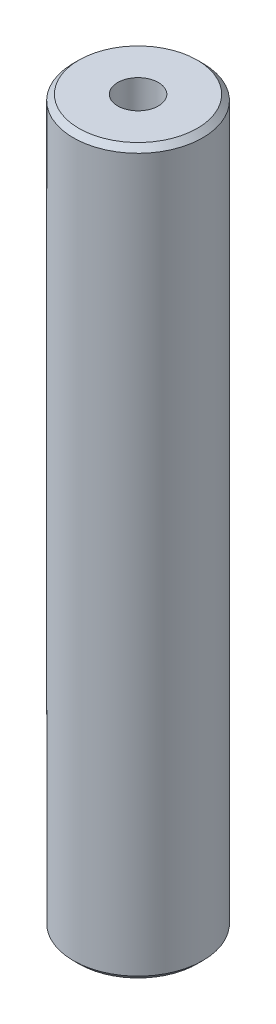
ISO-10303-21;
HEADER;
FILE_DESCRIPTION(('STEP AP214'),'2;1');
FILE_NAME('part.step','',(''),(''),'','','');
FILE_SCHEMA(('AUTOMOTIVE_DESIGN { 1 0 10303 214 1 1 1 1 }'));
ENDSEC;
DATA;
#1=APPLICATION_CONTEXT('core data for automotive mechanical design processes');
#2=APPLICATION_PROTOCOL_DEFINITION('international standard','automotive_design',2000,#1);
#3=PRODUCT_CONTEXT('',#1,'mechanical');
#4=PRODUCT('Part','Part','',(#3));
#5=PRODUCT_RELATED_PRODUCT_CATEGORY('part','',(#4));
#6=PRODUCT_DEFINITION_FORMATION('','',#4);
#7=PRODUCT_DEFINITION_CONTEXT('part definition',#1,'design');
#8=PRODUCT_DEFINITION('design','',#6,#7);
#9=PRODUCT_DEFINITION_SHAPE('','',#8);
#10=(LENGTH_UNIT() NAMED_UNIT(*) SI_UNIT(.MILLI.,.METRE.));
#11=(NAMED_UNIT(*) PLANE_ANGLE_UNIT() SI_UNIT($,.RADIAN.));
#12=(NAMED_UNIT(*) SI_UNIT($,.STERADIAN.) SOLID_ANGLE_UNIT());
#13=UNCERTAINTY_MEASURE_WITH_UNIT(LENGTH_MEASURE(1.E-05),#10,'distance_accuracy_value','');
#14=(GEOMETRIC_REPRESENTATION_CONTEXT(3) GLOBAL_UNCERTAINTY_ASSIGNED_CONTEXT((#13)) GLOBAL_UNIT_ASSIGNED_CONTEXT((#10,
#11,#12)) REPRESENTATION_CONTEXT('',''));
#15=CARTESIAN_POINT('',(0.,0.,0.));
#16=DIRECTION('',(0.,0.,1.));
#17=DIRECTION('',(1.,0.,0.));
#18=AXIS2_PLACEMENT_3D('',#15,#16,#17);
#19=CARTESIAN_POINT('',(0.,167.896019457677,0.));
#20=DIRECTION('',(0.,-1.,0.));
#21=DIRECTION('',(0.,0.,-1.));
#22=AXIS2_PLACEMENT_3D('',#19,#20,#21);
#23=CYLINDRICAL_SURFACE('',#22,15.);
#24=CARTESIAN_POINT('',(0.,166.628306279116,0.));
#25=DIRECTION('',(0.,1.,0.));
#26=DIRECTION('',(0.,0.,1.));
#27=AXIS2_PLACEMENT_3D('',#24,#25,#26);
#28=CIRCLE('',#27,15.);
#29=CARTESIAN_POINT('',(0.,166.628306279116,-15.));
#30=VERTEX_POINT('',#29);
#31=EDGE_CURVE('E50',#30,#30,#28,.F.);
#32=CARTESIAN_POINT('',(0.,1.26771317856134,0.));
#33=DIRECTION('',(0.,1.,0.));
#34=DIRECTION('',(0.,0.,1.));
#35=AXIS2_PLACEMENT_3D('',#32,#33,#34);
#36=CIRCLE('',#35,15.);
#37=CARTESIAN_POINT('',(0.,1.26771317856134,-15.));
#38=VERTEX_POINT('',#37);
#39=EDGE_CURVE('E51',#38,#38,#36,.T.);
#40=CARTESIAN_POINT('',(0.,166.628306279116,-15.));
#41=CARTESIAN_POINT('',(0.,164.905800100985,-15.));
#42=CARTESIAN_POINT('',(0.,163.183293922854,-15.));
#43=CARTESIAN_POINT('',(0.,159.738281566593,-15.));
#44=CARTESIAN_POINT('',(0.,158.015775388462,-15.));
#45=CARTESIAN_POINT('',(0.,154.570763032201,-15.));
#46=CARTESIAN_POINT('',(0.,152.84825685407,-15.));
#47=CARTESIAN_POINT('',(0.,149.403244497808,-15.));
#48=CARTESIAN_POINT('',(0.,147.680738319677,-15.));
#49=CARTESIAN_POINT('',(0.,144.235725963416,-15.));
#50=CARTESIAN_POINT('',(0.,142.513219785285,-15.));
#51=CARTESIAN_POINT('',(0.,139.068207429024,-15.));
#52=CARTESIAN_POINT('',(0.,137.345701250893,-15.));
#53=CARTESIAN_POINT('',(0.,133.900688894631,-15.));
#54=CARTESIAN_POINT('',(0.,132.1781827165,-15.));
#55=CARTESIAN_POINT('',(0.,128.733170360239,-15.));
#56=CARTESIAN_POINT('',(0.,127.010664182108,-15.));
#57=CARTESIAN_POINT('',(0.,123.565651825847,-15.));
#58=CARTESIAN_POINT('',(0.,121.843145647716,-15.));
#59=CARTESIAN_POINT('',(0.,118.398133291454,-15.));
#60=CARTESIAN_POINT('',(0.,116.675627113323,-15.));
#61=CARTESIAN_POINT('',(0.,113.230614757062,-15.));
#62=CARTESIAN_POINT('',(0.,111.508108578931,-15.));
#63=CARTESIAN_POINT('',(0.,108.06309622267,-15.));
#64=CARTESIAN_POINT('',(0.,106.340590044539,-15.));
#65=CARTESIAN_POINT('',(0.,102.895577688277,-15.));
#66=CARTESIAN_POINT('',(0.,101.173071510146,-15.));
#67=CARTESIAN_POINT('',(0.,97.7280591538849,-15.));
#68=CARTESIAN_POINT('',(0.,96.0055529757542,-15.));
#69=CARTESIAN_POINT('',(0.,92.5605406194926,-15.));
#70=CARTESIAN_POINT('',(0.,90.8380344413618,-15.));
#71=CARTESIAN_POINT('',(0.,87.3930220851003,-15.));
#72=CARTESIAN_POINT('',(0.,85.6705159069695,-15.));
#73=CARTESIAN_POINT('',(0.,82.2255035507079,-15.));
#74=CARTESIAN_POINT('',(0.,80.5029973725771,-15.));
#75=CARTESIAN_POINT('',(0.,77.0579850163156,-15.));
#76=CARTESIAN_POINT('',(0.,75.3354788381848,-15.));
#77=CARTESIAN_POINT('',(0.,71.8904664819233,-15.));
#78=CARTESIAN_POINT('',(0.,70.1679603037925,-15.));
#79=CARTESIAN_POINT('',(0.,66.7229479475309,-15.));
#80=CARTESIAN_POINT('',(0.,65.0004417694001,-15.));
#81=CARTESIAN_POINT('',(0.,61.5554294131386,-15.));
#82=CARTESIAN_POINT('',(0.,59.8329232350078,-15.));
#83=CARTESIAN_POINT('',(0.,56.3879108787462,-15.));
#84=CARTESIAN_POINT('',(0.,54.6654047006155,-15.));
#85=CARTESIAN_POINT('',(0.,51.2203923443539,-15.));
#86=CARTESIAN_POINT('',(0.,49.4978861662231,-15.));
#87=CARTESIAN_POINT('',(0.,46.0528738099616,-15.));
#88=CARTESIAN_POINT('',(0.,44.3303676318308,-15.));
#89=CARTESIAN_POINT('',(0.,40.8853552755692,-15.));
#90=CARTESIAN_POINT('',(0.,39.1628490974385,-15.));
#91=CARTESIAN_POINT('',(0.,35.7178367411769,-15.));
#92=CARTESIAN_POINT('',(0.,33.9953305630461,-15.));
#93=CARTESIAN_POINT('',(0.,30.5503182067846,-15.));
#94=CARTESIAN_POINT('',(0.,28.8278120286538,-15.));
#95=CARTESIAN_POINT('',(0.,25.3827996723922,-15.));
#96=CARTESIAN_POINT('',(0.,23.6602934942614,-15.));
#97=CARTESIAN_POINT('',(0.,20.2152811379999,-15.));
#98=CARTESIAN_POINT('',(0.,18.4927749598691,-15.));
#99=CARTESIAN_POINT('',(0.,15.0477626036076,-15.));
#100=CARTESIAN_POINT('',(0.,13.3252564254768,-15.));
#101=CARTESIAN_POINT('',(0.,9.88024406921523,-15.));
#102=CARTESIAN_POINT('',(0.,8.15773789108446,-15.));
#103=CARTESIAN_POINT('',(0.,4.7127255348229,-15.));
#104=CARTESIAN_POINT('',(0.,2.99021935669212,-15.));
#105=CARTESIAN_POINT('',(0.,1.26771317856134,-15.));
#106=B_SPLINE_CURVE_WITH_KNOTS('',3,(#40,#41,#42,#43,#44,#45,#46,#47,#48,#49,#50,#51,#52,#53,
#54,#55,#56,#57,#58,#59,#60,#61,#62,#63,#64,#65,#66,#67,#68,#69,#70,#71,#72,#73,#74,#75,#76,#77,
#78,#79,#80,#81,#82,#83,#84,#85,#86,#87,#88,#89,#90,#91,#92,#93,#94,#95,#96,#97,#98,#99,#100,
#101,#102,#103,#104,#105),.UNSPECIFIED.,.F.,.F.,(4,2,2,2,2,2,2,2,2,2,2,2,2,2,2,2,2,2,2,2,2,2,2,
2,2,2,2,2,2,2,2,2,4),(0.,5.16751853439232,10.3350370687847,15.502555603177,20.6700741375693,
25.8375926719616,31.005111206354,36.1726297407463,41.3401482751387,46.507666809531,
51.6751853439233,56.8427038783157,62.010222412708,67.1777409471003,72.3452594814927,
77.512778015885,82.6802965502773,87.8478150846697,93.015333619062,98.1828521534543,
103.350370687847,108.517889222239,113.685407756631,118.852926291024,124.020444825416,
129.187963359808,134.355481894201,139.523000428593,144.690518962985,149.858037497378,
155.02555603177,160.193074566162,165.360593100555),.UNSPECIFIED.);
#107=EDGE_CURVE('BSEAM39',#30,#38,#106,.T.);
#108=ORIENTED_EDGE('',*,*,#31,.T.);
#109=ORIENTED_EDGE('',*,*,#39,.T.);
#110=ORIENTED_EDGE('',*,*,#107,.T.);
#111=ORIENTED_EDGE('',*,*,#107,.F.);
#112=EDGE_LOOP('',(#108,#110,#109,#111));
#113=FACE_BOUND('',#112,.T.);
#114=ADVANCED_FACE('F39',(#113),#23,.T.);
#115=CARTESIAN_POINT('',(0.,167.896019457677,0.));
#116=DIRECTION('',(0.,1.,0.));
#117=DIRECTION('',(0.,0.,1.));
#118=AXIS2_PLACEMENT_3D('',#115,#116,#117);
#119=PLANE('',#118);
#120=CARTESIAN_POINT('',(0.,167.896019457677,0.));
#121=DIRECTION('',(0.,1.,0.));
#122=DIRECTION('',(0.,0.,1.));
#123=AXIS2_PLACEMENT_3D('',#120,#121,#122);
#124=CIRCLE('',#123,13.7322868214389);
#125=CARTESIAN_POINT('',(0.,167.896019457677,13.7322868214389));
#126=VERTEX_POINT('',#125);
#127=EDGE_CURVE('E54',#126,#126,#124,.T.);
#128=ORIENTED_EDGE('',*,*,#127,.T.);
#129=EDGE_LOOP('',(#128));
#130=FACE_BOUND('',#129,.T.);
#131=CARTESIAN_POINT('',(0.,167.896019457677,0.));
#132=DIRECTION('',(0.,1.,0.));
#133=DIRECTION('',(0.,0.,1.));
#134=AXIS2_PLACEMENT_3D('',#131,#132,#133);
#135=CIRCLE('',#134,4.72413045080099);
#136=CARTESIAN_POINT('',(0.,167.896019457677,-4.72413045080099));
#137=VERTEX_POINT('',#136);
#138=EDGE_CURVE('E58',#137,#137,#135,.T.);
#139=ORIENTED_EDGE('',*,*,#138,.F.);
#140=EDGE_LOOP('',(#139));
#141=FACE_BOUND('',#140,.T.);
#142=ADVANCED_FACE('F69',(#130,#141),#119,.T.);
#143=CARTESIAN_POINT('',(0.,0.,0.));
#144=DIRECTION('',(0.,1.,0.));
#145=DIRECTION('',(0.,0.,1.));
#146=AXIS2_PLACEMENT_3D('',#143,#144,#145);
#147=PLANE('',#146);
#148=CARTESIAN_POINT('',(0.,0.,0.));
#149=DIRECTION('',(0.,1.,0.));
#150=DIRECTION('',(0.,0.,1.));
#151=AXIS2_PLACEMENT_3D('',#148,#149,#150);
#152=CIRCLE('',#151,13.7322868214386);
#153=CARTESIAN_POINT('',(0.,0.,13.7322868214386));
#154=VERTEX_POINT('',#153);
#155=EDGE_CURVE('E10',#154,#154,#152,.F.);
#156=ORIENTED_EDGE('',*,*,#155,.T.);
#157=EDGE_LOOP('',(#156));
#158=FACE_BOUND('',#157,.T.);
#159=CARTESIAN_POINT('',(0.,0.,0.));
#160=DIRECTION('',(0.,1.,0.));
#161=DIRECTION('',(0.,0.,1.));
#162=AXIS2_PLACEMENT_3D('',#159,#160,#161);
#163=CIRCLE('',#162,4.72413045080099);
#164=CARTESIAN_POINT('',(0.,0.,-4.72413045080099));
#165=VERTEX_POINT('',#164);
#166=EDGE_CURVE('E63',#165,#165,#163,.T.);
#167=ORIENTED_EDGE('',*,*,#166,.T.);
#168=EDGE_LOOP('',(#167));
#169=FACE_BOUND('',#168,.T.);
#170=ADVANCED_FACE('F75',(#158,#169),#147,.F.);
#171=CARTESIAN_POINT('',(0.,167.896019457677,0.));
#172=DIRECTION('',(0.,-1.,0.));
#173=DIRECTION('',(0.,0.,-1.));
#174=AXIS2_PLACEMENT_3D('',#171,#172,#173);
#175=CYLINDRICAL_SURFACE('',#174,4.72413045080099);
#176=CARTESIAN_POINT('',(0.,167.896019457677,-4.72413045080099));
#177=CARTESIAN_POINT('',(0.,166.147102588326,-4.72413045080099));
#178=CARTESIAN_POINT('',(0.,164.398185718976,-4.72413045080099));
#179=CARTESIAN_POINT('',(0.,160.900351980274,-4.72413045080099));
#180=CARTESIAN_POINT('',(0.,159.151435110923,-4.72413045080099));
#181=CARTESIAN_POINT('',(0.,155.653601372222,-4.72413045080099));
#182=CARTESIAN_POINT('',(0.,153.904684502871,-4.72413045080099));
#183=CARTESIAN_POINT('',(0.,150.406850764169,-4.72413045080099));
#184=CARTESIAN_POINT('',(0.,148.657933894818,-4.72413045080099));
#185=CARTESIAN_POINT('',(0.,145.160100156117,-4.72413045080099));
#186=CARTESIAN_POINT('',(0.,143.411183286766,-4.72413045080099));
#187=CARTESIAN_POINT('',(0.,139.913349548064,-4.72413045080099));
#188=CARTESIAN_POINT('',(0.,138.164432678714,-4.72413045080099));
#189=CARTESIAN_POINT('',(0.,134.666598940012,-4.72413045080099));
#190=CARTESIAN_POINT('',(0.,132.917682070661,-4.72413045080099));
#191=CARTESIAN_POINT('',(0.,129.41984833196,-4.72413045080099));
#192=CARTESIAN_POINT('',(0.,127.670931462609,-4.72413045080099));
#193=CARTESIAN_POINT('',(0.,124.173097723907,-4.72413045080099));
#194=CARTESIAN_POINT('',(0.,122.424180854556,-4.72413045080099));
#195=CARTESIAN_POINT('',(0.,118.926347115855,-4.72413045080099));
#196=CARTESIAN_POINT('',(0.,117.177430246504,-4.72413045080099));
#197=CARTESIAN_POINT('',(0.,113.679596507802,-4.72413045080099));
#198=CARTESIAN_POINT('',(0.,111.930679638451,-4.72413045080099));
#199=CARTESIAN_POINT('',(0.,108.43284589975,-4.72413045080099));
#200=CARTESIAN_POINT('',(0.,106.683929030399,-4.72413045080099));
#201=CARTESIAN_POINT('',(0.,103.186095291697,-4.72413045080099));
#202=CARTESIAN_POINT('',(0.,101.437178422347,-4.72413045080099));
#203=CARTESIAN_POINT('',(0.,97.939344683645,-4.72413045080099));
#204=CARTESIAN_POINT('',(0.,96.1904278142942,-4.72413045080099));
#205=CARTESIAN_POINT('',(0.,92.6925940755926,-4.72413045080099));
#206=CARTESIAN_POINT('',(0.,90.9436772062418,-4.72413045080099));
#207=CARTESIAN_POINT('',(0.,87.4458434675402,-4.72413045080099));
#208=CARTESIAN_POINT('',(0.,85.6969265981894,-4.72413045080099));
#209=CARTESIAN_POINT('',(0.,82.1990928594878,-4.72413045080099));
#210=CARTESIAN_POINT('',(0.,80.450175990137,-4.72413045080099));
#211=CARTESIAN_POINT('',(0.,76.9523422514354,-4.72413045080099));
#212=CARTESIAN_POINT('',(0.,75.2034253820846,-4.72413045080099));
#213=CARTESIAN_POINT('',(0.,71.705591643383,-4.72413045080099));
#214=CARTESIAN_POINT('',(0.,69.9566747740322,-4.72413045080099));
#215=CARTESIAN_POINT('',(0.,66.4588410353306,-4.72413045080099));
#216=CARTESIAN_POINT('',(0.,64.7099241659797,-4.72413045080099));
#217=CARTESIAN_POINT('',(0.,61.2120904272781,-4.72413045080099));
#218=CARTESIAN_POINT('',(0.,59.4631735579273,-4.72413045080099));
#219=CARTESIAN_POINT('',(0.,55.9653398192257,-4.72413045080099));
#220=CARTESIAN_POINT('',(0.,54.2164229498749,-4.72413045080099));
#221=CARTESIAN_POINT('',(0.,50.7185892111733,-4.72413045080099));
#222=CARTESIAN_POINT('',(0.,48.9696723418225,-4.72413045080099));
#223=CARTESIAN_POINT('',(0.,45.4718386031209,-4.72413045080099));
#224=CARTESIAN_POINT('',(0.,43.7229217337701,-4.72413045080099));
#225=CARTESIAN_POINT('',(0.,40.2250879950685,-4.72413045080099));
#226=CARTESIAN_POINT('',(0.,38.4761711257177,-4.72413045080099));
#227=CARTESIAN_POINT('',(0.,34.9783373870161,-4.72413045080099));
#228=CARTESIAN_POINT('',(0.,33.2294205176653,-4.72413045080099));
#229=CARTESIAN_POINT('',(0.,29.7315867789637,-4.72413045080099));
#230=CARTESIAN_POINT('',(0.,27.9826699096129,-4.72413045080099));
#231=CARTESIAN_POINT('',(0.,24.4848361709113,-4.72413045080099));
#232=CARTESIAN_POINT('',(0.,22.7359193015605,-4.72413045080099));
#233=CARTESIAN_POINT('',(0.,19.2380855628589,-4.72413045080099));
#234=CARTESIAN_POINT('',(0.,17.4891686935081,-4.72413045080099));
#235=CARTESIAN_POINT('',(0.,13.9913349548064,-4.72413045080099));
#236=CARTESIAN_POINT('',(0.,12.2424180854556,-4.72413045080099));
#237=CARTESIAN_POINT('',(0.,8.74458434675401,-4.72413045080099));
#238=CARTESIAN_POINT('',(0.,6.99566747740321,-4.72413045080099));
#239=CARTESIAN_POINT('',(0.,3.49783373870161,-4.72413045080099));
#240=CARTESIAN_POINT('',(0.,1.7489168693508,-4.72413045080099));
#241=CARTESIAN_POINT('',(0.,0.,-4.72413045080099));
#242=B_SPLINE_CURVE_WITH_KNOTS('',3,(#176,#177,#178,#179,#180,#181,#182,#183,#184,#185,#186,
#187,#188,#189,#190,#191,#192,#193,#194,#195,#196,#197,#198,#199,#200,#201,#202,#203,#204,#205,
#206,#207,#208,#209,#210,#211,#212,#213,#214,#215,#216,#217,#218,#219,#220,#221,#222,#223,#224,
#225,#226,#227,#228,#229,#230,#231,#232,#233,#234,#235,#236,#237,#238,#239,#240,#241),
.UNSPECIFIED.,.F.,.F.,(4,2,2,2,2,2,2,2,2,2,2,2,2,2,2,2,2,2,2,2,2,2,2,2,2,2,2,2,2,2,2,2,4),(0.,
5.24675060805244,10.4935012161048,15.7402518241573,20.9870024322097,26.2337530402621,
31.4805036483145,36.7272542563669,41.9740048644193,47.2207554724717,52.4675060805241,
57.7142566885765,62.961007296629,68.2077579046814,73.4545085127338,78.7012591207862,
83.9480097288386,89.194760336891,94.4415109449434,99.6882615529959,104.935012161048,
110.181762769101,115.428513377153,120.675263985206,125.922014593258,131.16876520131,
136.415515809363,141.662266417415,146.909017025468,152.15576763352,157.402518241572,
162.649268849625,167.896019457677),.UNSPECIFIED.);
#243=EDGE_CURVE('BSEAM70',#137,#165,#242,.T.);
#244=ORIENTED_EDGE('',*,*,#138,.T.);
#245=ORIENTED_EDGE('',*,*,#166,.F.);
#246=ORIENTED_EDGE('',*,*,#243,.T.);
#247=ORIENTED_EDGE('',*,*,#243,.F.);
#248=EDGE_LOOP('',(#244,#246,#245,#247));
#249=FACE_BOUND('',#248,.T.);
#250=ADVANCED_FACE('F70',(#249),#175,.F.);
#251=CARTESIAN_POINT('',(0.,167.896019457677,0.));
#252=DIRECTION('',(0.,-1.,0.));
#253=DIRECTION('',(0.,0.,-1.));
#254=AXIS2_PLACEMENT_3D('',#251,#252,#253);
#255=CONICAL_SURFACE('',#254,13.7322868214389,0.785398163397444);
#256=ORIENTED_EDGE('',*,*,#31,.F.);
#257=EDGE_LOOP('',(#256));
#258=FACE_BOUND('',#257,.T.);
#259=ORIENTED_EDGE('',*,*,#127,.F.);
#260=EDGE_LOOP('',(#259));
#261=FACE_BOUND('',#260,.T.);
#262=ADVANCED_FACE('F81',(#258,#261),#255,.T.);
#263=CARTESIAN_POINT('',(0.,1.26771317856134,0.));
#264=DIRECTION('',(0.,1.,0.));
#265=DIRECTION('',(0.,0.,1.));
#266=AXIS2_PLACEMENT_3D('',#263,#264,#265);
#267=CONICAL_SURFACE('',#266,15.,0.785398163397455);
#268=ORIENTED_EDGE('',*,*,#155,.F.);
#269=EDGE_LOOP('',(#268));
#270=FACE_BOUND('',#269,.T.);
#271=ORIENTED_EDGE('',*,*,#39,.F.);
#272=EDGE_LOOP('',(#271));
#273=FACE_BOUND('',#272,.T.);
#274=ADVANCED_FACE('F45',(#270,#273),#267,.T.);
#275=CLOSED_SHELL('',(#114,#142,#170,#250,#262,#274));
#276=MANIFOLD_SOLID_BREP('B2',#275);
#277=ADVANCED_BREP_SHAPE_REPRESENTATION('',(#18,#276),#14);
#278=SHAPE_DEFINITION_REPRESENTATION(#9,#277);
ENDSEC;
END-ISO-10303-21;
